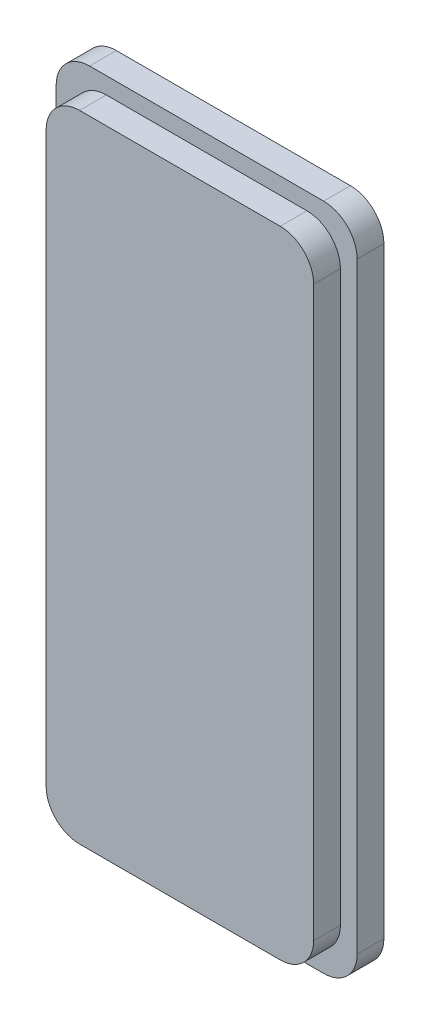
ISO-10303-21;
HEADER;
FILE_DESCRIPTION(('STEP AP214'),'2;1');
FILE_NAME('part.step','',(''),(''),'','','');
FILE_SCHEMA(('AUTOMOTIVE_DESIGN { 1 0 10303 214 1 1 1 1 }'));
ENDSEC;
DATA;
#1=APPLICATION_CONTEXT('core data for automotive mechanical design processes');
#2=APPLICATION_PROTOCOL_DEFINITION('international standard','automotive_design',2000,#1);
#3=PRODUCT_CONTEXT('',#1,'mechanical');
#4=PRODUCT('Part','Part','',(#3));
#5=PRODUCT_RELATED_PRODUCT_CATEGORY('part','',(#4));
#6=PRODUCT_DEFINITION_FORMATION('','',#4);
#7=PRODUCT_DEFINITION_CONTEXT('part definition',#1,'design');
#8=PRODUCT_DEFINITION('design','',#6,#7);
#9=PRODUCT_DEFINITION_SHAPE('','',#8);
#10=(LENGTH_UNIT() NAMED_UNIT(*) SI_UNIT(.MILLI.,.METRE.));
#11=(NAMED_UNIT(*) PLANE_ANGLE_UNIT() SI_UNIT($,.RADIAN.));
#12=(NAMED_UNIT(*) SI_UNIT($,.STERADIAN.) SOLID_ANGLE_UNIT());
#13=UNCERTAINTY_MEASURE_WITH_UNIT(LENGTH_MEASURE(1.E-05),#10,'distance_accuracy_value','');
#14=(GEOMETRIC_REPRESENTATION_CONTEXT(3) GLOBAL_UNCERTAINTY_ASSIGNED_CONTEXT((#13)) GLOBAL_UNIT_ASSIGNED_CONTEXT((#10,
#11,#12)) REPRESENTATION_CONTEXT('',''));
#15=CARTESIAN_POINT('',(0.,0.,0.));
#16=DIRECTION('',(0.,0.,1.));
#17=DIRECTION('',(1.,0.,0.));
#18=AXIS2_PLACEMENT_3D('',#15,#16,#17);
#19=CARTESIAN_POINT('',(0.,0.,4.));
#20=DIRECTION('',(0.,0.,-1.));
#21=DIRECTION('',(-1.,0.,0.));
#22=AXIS2_PLACEMENT_3D('',#19,#20,#21);
#23=PLANE('',#22);
#24=DIRECTION('',(1.,0.,0.));
#25=VECTOR('',#24,1.);
#26=CARTESIAN_POINT('',(-22.5,-50.,4.));
#27=LINE('',#26,#25);
#28=CARTESIAN_POINT('',(-17.5,-50.,4.));
#29=VERTEX_POINT('',#28);
#30=CARTESIAN_POINT('',(17.5,-50.,4.));
#31=VERTEX_POINT('',#30);
#32=EDGE_CURVE('E195',#29,#31,#27,.T.);
#33=ORIENTED_EDGE('',*,*,#32,.T.);
#34=CARTESIAN_POINT('',(17.5,-45.,4.));
#35=DIRECTION('',(0.,0.,-1.));
#36=DIRECTION('',(-1.,0.,0.));
#37=AXIS2_PLACEMENT_3D('',#34,#35,#36);
#38=CIRCLE('',#37,5.);
#39=CARTESIAN_POINT('',(22.5,-45.,4.));
#40=VERTEX_POINT('',#39);
#41=EDGE_CURVE('E254',#31,#40,#38,.F.);
#42=ORIENTED_EDGE('',*,*,#41,.T.);
#43=DIRECTION('',(0.,1.,0.));
#44=VECTOR('',#43,1.);
#45=CARTESIAN_POINT('',(22.5,-50.,4.));
#46=LINE('',#45,#44);
#47=CARTESIAN_POINT('',(22.5,45.,4.));
#48=VERTEX_POINT('',#47);
#49=EDGE_CURVE('E187',#40,#48,#46,.T.);
#50=ORIENTED_EDGE('',*,*,#49,.T.);
#51=CARTESIAN_POINT('',(17.5,45.,4.));
#52=DIRECTION('',(0.,0.,-1.));
#53=DIRECTION('',(-1.,0.,0.));
#54=AXIS2_PLACEMENT_3D('',#51,#52,#53);
#55=CIRCLE('',#54,5.);
#56=CARTESIAN_POINT('',(17.5,50.,4.));
#57=VERTEX_POINT('',#56);
#58=EDGE_CURVE('E250',#48,#57,#55,.F.);
#59=ORIENTED_EDGE('',*,*,#58,.T.);
#60=DIRECTION('',(-1.,0.,0.));
#61=VECTOR('',#60,1.);
#62=CARTESIAN_POINT('',(-22.5,50.,4.));
#63=LINE('',#62,#61);
#64=CARTESIAN_POINT('',(-17.5,50.,4.));
#65=VERTEX_POINT('',#64);
#66=EDGE_CURVE('E190',#57,#65,#63,.T.);
#67=ORIENTED_EDGE('',*,*,#66,.T.);
#68=CARTESIAN_POINT('',(-17.5,45.,4.));
#69=DIRECTION('',(0.,0.,-1.));
#70=DIRECTION('',(-1.,0.,0.));
#71=AXIS2_PLACEMENT_3D('',#68,#69,#70);
#72=CIRCLE('',#71,5.);
#73=CARTESIAN_POINT('',(-22.5,45.,4.));
#74=VERTEX_POINT('',#73);
#75=EDGE_CURVE('E59',#65,#74,#72,.F.);
#76=ORIENTED_EDGE('',*,*,#75,.T.);
#77=DIRECTION('',(0.,-1.,0.));
#78=VECTOR('',#77,1.);
#79=CARTESIAN_POINT('',(-22.5,-50.,4.));
#80=LINE('',#79,#78);
#81=CARTESIAN_POINT('',(-22.5,-45.,4.));
#82=VERTEX_POINT('',#81);
#83=EDGE_CURVE('E193',#74,#82,#80,.T.);
#84=ORIENTED_EDGE('',*,*,#83,.T.);
#85=CARTESIAN_POINT('',(-17.5,-45.,4.));
#86=DIRECTION('',(0.,0.,-1.));
#87=DIRECTION('',(-1.,0.,0.));
#88=AXIS2_PLACEMENT_3D('',#85,#86,#87);
#89=CIRCLE('',#88,5.);
#90=EDGE_CURVE('E252',#82,#29,#89,.F.);
#91=ORIENTED_EDGE('',*,*,#90,.T.);
#92=EDGE_LOOP('',(#33,#42,#50,#59,#67,#76,#84,#91));
#93=FACE_BOUND('',#92,.T.);
#94=DIRECTION('',(0.,1.,0.));
#95=VECTOR('',#94,1.);
#96=CARTESIAN_POINT('',(20.,-47.5,4.));
#97=LINE('',#96,#95);
#98=CARTESIAN_POINT('',(20.,-42.5,4.));
#99=VERTEX_POINT('',#98);
#100=CARTESIAN_POINT('',(20.,42.5,4.));
#101=VERTEX_POINT('',#100);
#102=EDGE_CURVE('E183',#99,#101,#97,.T.);
#103=ORIENTED_EDGE('',*,*,#102,.F.);
#104=CARTESIAN_POINT('',(15.,-42.5,4.));
#105=DIRECTION('',(0.,0.,-1.));
#106=DIRECTION('',(-1.,0.,0.));
#107=AXIS2_PLACEMENT_3D('',#104,#105,#106);
#108=CIRCLE('',#107,5.);
#109=CARTESIAN_POINT('',(15.,-47.5,4.));
#110=VERTEX_POINT('',#109);
#111=EDGE_CURVE('E45',#99,#110,#108,.T.);
#112=ORIENTED_EDGE('',*,*,#111,.T.);
#113=DIRECTION('',(1.,0.,0.));
#114=VECTOR('',#113,1.);
#115=CARTESIAN_POINT('',(-20.,-47.5,4.));
#116=LINE('',#115,#114);
#117=CARTESIAN_POINT('',(-15.,-47.5,4.));
#118=VERTEX_POINT('',#117);
#119=EDGE_CURVE('E177',#118,#110,#116,.T.);
#120=ORIENTED_EDGE('',*,*,#119,.F.);
#121=CARTESIAN_POINT('',(-15.,-42.5,4.));
#122=DIRECTION('',(0.,0.,-1.));
#123=DIRECTION('',(-1.,0.,0.));
#124=AXIS2_PLACEMENT_3D('',#121,#122,#123);
#125=CIRCLE('',#124,5.);
#126=CARTESIAN_POINT('',(-20.,-42.5,4.));
#127=VERTEX_POINT('',#126);
#128=EDGE_CURVE('E11',#118,#127,#125,.T.);
#129=ORIENTED_EDGE('',*,*,#128,.T.);
#130=DIRECTION('',(0.,-1.,0.));
#131=VECTOR('',#130,1.);
#132=CARTESIAN_POINT('',(-20.,-47.5,4.));
#133=LINE('',#132,#131);
#134=CARTESIAN_POINT('',(-20.,42.5,4.));
#135=VERTEX_POINT('',#134);
#136=EDGE_CURVE('E168',#135,#127,#133,.T.);
#137=ORIENTED_EDGE('',*,*,#136,.F.);
#138=CARTESIAN_POINT('',(-15.,42.5,4.));
#139=DIRECTION('',(0.,0.,-1.));
#140=DIRECTION('',(-1.,0.,0.));
#141=AXIS2_PLACEMENT_3D('',#138,#139,#140);
#142=CIRCLE('',#141,5.);
#143=CARTESIAN_POINT('',(-15.,47.5,4.));
#144=VERTEX_POINT('',#143);
#145=EDGE_CURVE('E151',#135,#144,#142,.T.);
#146=ORIENTED_EDGE('',*,*,#145,.T.);
#147=DIRECTION('',(-1.,0.,0.));
#148=VECTOR('',#147,1.);
#149=CARTESIAN_POINT('',(-20.,47.5,4.));
#150=LINE('',#149,#148);
#151=CARTESIAN_POINT('',(15.,47.5,4.));
#152=VERTEX_POINT('',#151);
#153=EDGE_CURVE('E178',#152,#144,#150,.T.);
#154=ORIENTED_EDGE('',*,*,#153,.F.);
#155=CARTESIAN_POINT('',(15.,42.5,4.));
#156=DIRECTION('',(0.,0.,-1.));
#157=DIRECTION('',(-1.,0.,0.));
#158=AXIS2_PLACEMENT_3D('',#155,#156,#157);
#159=CIRCLE('',#158,5.);
#160=EDGE_CURVE('E161',#152,#101,#159,.T.);
#161=ORIENTED_EDGE('',*,*,#160,.T.);
#162=EDGE_LOOP('',(#103,#112,#120,#129,#137,#146,#154,#161));
#163=FACE_BOUND('',#162,.T.);
#164=ADVANCED_FACE('F37',(#93,#163),#23,.F.);
#165=CARTESIAN_POINT('',(22.5,-50.,4.));
#166=DIRECTION('',(-1.,0.,0.));
#167=DIRECTION('',(0.,0.,1.));
#168=AXIS2_PLACEMENT_3D('',#165,#166,#167);
#169=PLANE('',#168);
#170=ORIENTED_EDGE('',*,*,#49,.F.);
#171=DIRECTION('',(0.,0.,-1.));
#172=VECTOR('',#171,1.);
#173=CARTESIAN_POINT('',(22.5,-45.,4.));
#174=LINE('',#173,#172);
#175=CARTESIAN_POINT('',(22.5,-45.,0.));
#176=VERTEX_POINT('',#175);
#177=EDGE_CURVE('E233',#40,#176,#174,.T.);
#178=ORIENTED_EDGE('',*,*,#177,.T.);
#179=DIRECTION('',(0.,1.,0.));
#180=VECTOR('',#179,1.);
#181=CARTESIAN_POINT('',(22.5,-50.,0.));
#182=LINE('',#181,#180);
#183=CARTESIAN_POINT('',(22.5,45.,0.));
#184=VERTEX_POINT('',#183);
#185=EDGE_CURVE('E198',#176,#184,#182,.T.);
#186=ORIENTED_EDGE('',*,*,#185,.T.);
#187=DIRECTION('',(0.,0.,-1.));
#188=VECTOR('',#187,1.);
#189=CARTESIAN_POINT('',(22.5,45.,4.));
#190=LINE('',#189,#188);
#191=EDGE_CURVE('E231',#184,#48,#190,.F.);
#192=ORIENTED_EDGE('',*,*,#191,.T.);
#193=EDGE_LOOP('',(#170,#178,#186,#192));
#194=FACE_BOUND('',#193,.T.);
#195=ADVANCED_FACE('F305',(#194),#169,.F.);
#196=CARTESIAN_POINT('',(-22.5,50.,4.));
#197=DIRECTION('',(0.,-1.,0.));
#198=DIRECTION('',(0.,0.,-1.));
#199=AXIS2_PLACEMENT_3D('',#196,#197,#198);
#200=PLANE('',#199);
#201=ORIENTED_EDGE('',*,*,#66,.F.);
#202=DIRECTION('',(0.,0.,-1.));
#203=VECTOR('',#202,1.);
#204=CARTESIAN_POINT('',(17.5,50.,4.));
#205=LINE('',#204,#203);
#206=CARTESIAN_POINT('',(17.5,50.,0.));
#207=VERTEX_POINT('',#206);
#208=EDGE_CURVE('E162',#57,#207,#205,.T.);
#209=ORIENTED_EDGE('',*,*,#208,.T.);
#210=DIRECTION('',(-1.,0.,0.));
#211=VECTOR('',#210,1.);
#212=CARTESIAN_POINT('',(-22.5,50.,0.));
#213=LINE('',#212,#211);
#214=CARTESIAN_POINT('',(-17.5,50.,0.));
#215=VERTEX_POINT('',#214);
#216=EDGE_CURVE('E201',#207,#215,#213,.T.);
#217=ORIENTED_EDGE('',*,*,#216,.T.);
#218=DIRECTION('',(0.,0.,-1.));
#219=VECTOR('',#218,1.);
#220=CARTESIAN_POINT('',(-17.5,50.,4.));
#221=LINE('',#220,#219);
#222=EDGE_CURVE('E260',#215,#65,#221,.F.);
#223=ORIENTED_EDGE('',*,*,#222,.T.);
#224=EDGE_LOOP('',(#201,#209,#217,#223));
#225=FACE_BOUND('',#224,.T.);
#226=ADVANCED_FACE('F310',(#225),#200,.F.);
#227=CARTESIAN_POINT('',(-22.5,-50.,4.));
#228=DIRECTION('',(1.,0.,0.));
#229=DIRECTION('',(0.,0.,-1.));
#230=AXIS2_PLACEMENT_3D('',#227,#228,#229);
#231=PLANE('',#230);
#232=DIRECTION('',(0.,-1.,0.));
#233=VECTOR('',#232,1.);
#234=CARTESIAN_POINT('',(-22.5,-50.,0.));
#235=LINE('',#234,#233);
#236=CARTESIAN_POINT('',(-22.5,45.,0.));
#237=VERTEX_POINT('',#236);
#238=CARTESIAN_POINT('',(-22.5,-45.,0.));
#239=VERTEX_POINT('',#238);
#240=EDGE_CURVE('E205',#237,#239,#235,.T.);
#241=ORIENTED_EDGE('',*,*,#240,.T.);
#242=DIRECTION('',(0.,0.,-1.));
#243=VECTOR('',#242,1.);
#244=CARTESIAN_POINT('',(-22.5,-45.,4.));
#245=LINE('',#244,#243);
#246=EDGE_CURVE('E52',#239,#82,#245,.F.);
#247=ORIENTED_EDGE('',*,*,#246,.T.);
#248=ORIENTED_EDGE('',*,*,#83,.F.);
#249=DIRECTION('',(0.,0.,-1.));
#250=VECTOR('',#249,1.);
#251=CARTESIAN_POINT('',(-22.5,45.,4.));
#252=LINE('',#251,#250);
#253=EDGE_CURVE('E256',#74,#237,#252,.T.);
#254=ORIENTED_EDGE('',*,*,#253,.T.);
#255=EDGE_LOOP('',(#241,#247,#248,#254));
#256=FACE_BOUND('',#255,.T.);
#257=ADVANCED_FACE('F320',(#256),#231,.F.);
#258=CARTESIAN_POINT('',(-22.5,-50.,4.));
#259=DIRECTION('',(0.,1.,0.));
#260=DIRECTION('',(0.,0.,1.));
#261=AXIS2_PLACEMENT_3D('',#258,#259,#260);
#262=PLANE('',#261);
#263=DIRECTION('',(1.,0.,0.));
#264=VECTOR('',#263,1.);
#265=CARTESIAN_POINT('',(-22.5,-50.,0.));
#266=LINE('',#265,#264);
#267=CARTESIAN_POINT('',(-17.5,-50.,0.));
#268=VERTEX_POINT('',#267);
#269=CARTESIAN_POINT('',(17.5,-50.,0.));
#270=VERTEX_POINT('',#269);
#271=EDGE_CURVE('E191',#268,#270,#266,.T.);
#272=ORIENTED_EDGE('',*,*,#271,.T.);
#273=DIRECTION('',(0.,0.,-1.));
#274=VECTOR('',#273,1.);
#275=CARTESIAN_POINT('',(17.5,-50.,4.));
#276=LINE('',#275,#274);
#277=EDGE_CURVE('E247',#270,#31,#276,.F.);
#278=ORIENTED_EDGE('',*,*,#277,.T.);
#279=ORIENTED_EDGE('',*,*,#32,.F.);
#280=DIRECTION('',(0.,0.,-1.));
#281=VECTOR('',#280,1.);
#282=CARTESIAN_POINT('',(-17.5,-50.,4.));
#283=LINE('',#282,#281);
#284=EDGE_CURVE('E244',#29,#268,#283,.T.);
#285=ORIENTED_EDGE('',*,*,#284,.T.);
#286=EDGE_LOOP('',(#272,#278,#279,#285));
#287=FACE_BOUND('',#286,.T.);
#288=ADVANCED_FACE('F316',(#287),#262,.F.);
#289=CARTESIAN_POINT('',(0.,0.,0.));
#290=DIRECTION('',(0.,0.,-1.));
#291=DIRECTION('',(-1.,0.,0.));
#292=AXIS2_PLACEMENT_3D('',#289,#290,#291);
#293=PLANE('',#292);
#294=ORIENTED_EDGE('',*,*,#185,.F.);
#295=CARTESIAN_POINT('',(17.5,-45.,0.));
#296=DIRECTION('',(0.,0.,-1.));
#297=DIRECTION('',(-1.,0.,0.));
#298=AXIS2_PLACEMENT_3D('',#295,#296,#297);
#299=CIRCLE('',#298,5.);
#300=EDGE_CURVE('E242',#176,#270,#299,.T.);
#301=ORIENTED_EDGE('',*,*,#300,.T.);
#302=ORIENTED_EDGE('',*,*,#271,.F.);
#303=CARTESIAN_POINT('',(-17.5,-45.,0.));
#304=DIRECTION('',(0.,0.,-1.));
#305=DIRECTION('',(-1.,0.,0.));
#306=AXIS2_PLACEMENT_3D('',#303,#304,#305);
#307=CIRCLE('',#306,5.);
#308=EDGE_CURVE('E240',#268,#239,#307,.T.);
#309=ORIENTED_EDGE('',*,*,#308,.T.);
#310=ORIENTED_EDGE('',*,*,#240,.F.);
#311=CARTESIAN_POINT('',(-17.5,45.,0.));
#312=DIRECTION('',(0.,0.,-1.));
#313=DIRECTION('',(-1.,0.,0.));
#314=AXIS2_PLACEMENT_3D('',#311,#312,#313);
#315=CIRCLE('',#314,5.);
#316=EDGE_CURVE('E236',#237,#215,#315,.T.);
#317=ORIENTED_EDGE('',*,*,#316,.T.);
#318=ORIENTED_EDGE('',*,*,#216,.F.);
#319=CARTESIAN_POINT('',(17.5,45.,0.));
#320=DIRECTION('',(0.,0.,-1.));
#321=DIRECTION('',(-1.,0.,0.));
#322=AXIS2_PLACEMENT_3D('',#319,#320,#321);
#323=CIRCLE('',#322,5.);
#324=EDGE_CURVE('E238',#207,#184,#323,.T.);
#325=ORIENTED_EDGE('',*,*,#324,.T.);
#326=EDGE_LOOP('',(#294,#301,#302,#309,#310,#317,#318,#325));
#327=FACE_BOUND('',#326,.T.);
#328=ADVANCED_FACE('F302',(#327),#293,.T.);
#329=CARTESIAN_POINT('',(20.,-47.5,8.));
#330=DIRECTION('',(-1.,0.,0.));
#331=DIRECTION('',(0.,0.,1.));
#332=AXIS2_PLACEMENT_3D('',#329,#330,#331);
#333=PLANE('',#332);
#334=ORIENTED_EDGE('',*,*,#102,.T.);
#335=DIRECTION('',(0.,0.,-1.));
#336=VECTOR('',#335,1.);
#337=CARTESIAN_POINT('',(20.,42.5,8.));
#338=LINE('',#337,#336);
#339=CARTESIAN_POINT('',(20.,42.5,8.));
#340=VERTEX_POINT('',#339);
#341=EDGE_CURVE('E224',#101,#340,#338,.F.);
#342=ORIENTED_EDGE('',*,*,#341,.T.);
#343=DIRECTION('',(0.,1.,0.));
#344=VECTOR('',#343,1.);
#345=CARTESIAN_POINT('',(20.,-47.5,8.));
#346=LINE('',#345,#344);
#347=CARTESIAN_POINT('',(20.,-42.5,8.));
#348=VERTEX_POINT('',#347);
#349=EDGE_CURVE('E181',#348,#340,#346,.T.);
#350=ORIENTED_EDGE('',*,*,#349,.F.);
#351=DIRECTION('',(0.,0.,-1.));
#352=VECTOR('',#351,1.);
#353=CARTESIAN_POINT('',(20.,-42.5,8.));
#354=LINE('',#353,#352);
#355=EDGE_CURVE('E221',#348,#99,#354,.T.);
#356=ORIENTED_EDGE('',*,*,#355,.T.);
#357=EDGE_LOOP('',(#334,#342,#350,#356));
#358=FACE_BOUND('',#357,.T.);
#359=ADVANCED_FACE('F282',(#358),#333,.F.);
#360=CARTESIAN_POINT('',(-20.,47.5,8.));
#361=DIRECTION('',(0.,-1.,0.));
#362=DIRECTION('',(0.,0.,-1.));
#363=AXIS2_PLACEMENT_3D('',#360,#361,#362);
#364=PLANE('',#363);
#365=ORIENTED_EDGE('',*,*,#153,.T.);
#366=DIRECTION('',(0.,0.,-1.));
#367=VECTOR('',#366,1.);
#368=CARTESIAN_POINT('',(-15.,47.5,8.));
#369=LINE('',#368,#367);
#370=CARTESIAN_POINT('',(-15.,47.5,8.));
#371=VERTEX_POINT('',#370);
#372=EDGE_CURVE('E156',#144,#371,#369,.F.);
#373=ORIENTED_EDGE('',*,*,#372,.T.);
#374=DIRECTION('',(-1.,0.,0.));
#375=VECTOR('',#374,1.);
#376=CARTESIAN_POINT('',(-20.,47.5,8.));
#377=LINE('',#376,#375);
#378=CARTESIAN_POINT('',(15.,47.5,8.));
#379=VERTEX_POINT('',#378);
#380=EDGE_CURVE('E284',#379,#371,#377,.T.);
#381=ORIENTED_EDGE('',*,*,#380,.F.);
#382=DIRECTION('',(0.,0.,-1.));
#383=VECTOR('',#382,1.);
#384=CARTESIAN_POINT('',(15.,47.5,8.));
#385=LINE('',#384,#383);
#386=EDGE_CURVE('E172',#379,#152,#385,.T.);
#387=ORIENTED_EDGE('',*,*,#386,.T.);
#388=EDGE_LOOP('',(#365,#373,#381,#387));
#389=FACE_BOUND('',#388,.T.);
#390=ADVANCED_FACE('F294',(#389),#364,.F.);
#391=CARTESIAN_POINT('',(-20.,-47.5,8.));
#392=DIRECTION('',(1.,0.,0.));
#393=DIRECTION('',(0.,0.,-1.));
#394=AXIS2_PLACEMENT_3D('',#391,#392,#393);
#395=PLANE('',#394);
#396=DIRECTION('',(0.,-1.,0.));
#397=VECTOR('',#396,1.);
#398=CARTESIAN_POINT('',(-20.,-47.5,8.));
#399=LINE('',#398,#397);
#400=CARTESIAN_POINT('',(-20.,42.5,8.));
#401=VERTEX_POINT('',#400);
#402=CARTESIAN_POINT('',(-20.,-42.5,8.));
#403=VERTEX_POINT('',#402);
#404=EDGE_CURVE('E171',#401,#403,#399,.T.);
#405=ORIENTED_EDGE('',*,*,#404,.F.);
#406=DIRECTION('',(0.,0.,-1.));
#407=VECTOR('',#406,1.);
#408=CARTESIAN_POINT('',(-20.,42.5,8.));
#409=LINE('',#408,#407);
#410=EDGE_CURVE('E155',#401,#135,#409,.T.);
#411=ORIENTED_EDGE('',*,*,#410,.T.);
#412=ORIENTED_EDGE('',*,*,#136,.T.);
#413=DIRECTION('',(0.,0.,-1.));
#414=VECTOR('',#413,1.);
#415=CARTESIAN_POINT('',(-20.,-42.5,8.));
#416=LINE('',#415,#414);
#417=EDGE_CURVE('E173',#127,#403,#416,.F.);
#418=ORIENTED_EDGE('',*,*,#417,.T.);
#419=EDGE_LOOP('',(#405,#411,#412,#418));
#420=FACE_BOUND('',#419,.T.);
#421=ADVANCED_FACE('F167',(#420),#395,.F.);
#422=CARTESIAN_POINT('',(-20.,-47.5,8.));
#423=DIRECTION('',(0.,1.,0.));
#424=DIRECTION('',(0.,0.,1.));
#425=AXIS2_PLACEMENT_3D('',#422,#423,#424);
#426=PLANE('',#425);
#427=ORIENTED_EDGE('',*,*,#119,.T.);
#428=DIRECTION('',(0.,0.,-1.));
#429=VECTOR('',#428,1.);
#430=CARTESIAN_POINT('',(15.,-47.5,8.));
#431=LINE('',#430,#429);
#432=CARTESIAN_POINT('',(15.,-47.5,8.));
#433=VERTEX_POINT('',#432);
#434=EDGE_CURVE('E229',#110,#433,#431,.F.);
#435=ORIENTED_EDGE('',*,*,#434,.T.);
#436=DIRECTION('',(1.,0.,0.));
#437=VECTOR('',#436,1.);
#438=CARTESIAN_POINT('',(-20.,-47.5,8.));
#439=LINE('',#438,#437);
#440=CARTESIAN_POINT('',(-15.,-47.5,8.));
#441=VERTEX_POINT('',#440);
#442=EDGE_CURVE('E202',#441,#433,#439,.T.);
#443=ORIENTED_EDGE('',*,*,#442,.F.);
#444=DIRECTION('',(0.,0.,-1.));
#445=VECTOR('',#444,1.);
#446=CARTESIAN_POINT('',(-15.,-47.5,8.));
#447=LINE('',#446,#445);
#448=EDGE_CURVE('E226',#441,#118,#447,.T.);
#449=ORIENTED_EDGE('',*,*,#448,.T.);
#450=EDGE_LOOP('',(#427,#435,#443,#449));
#451=FACE_BOUND('',#450,.T.);
#452=ADVANCED_FACE('F269',(#451),#426,.F.);
#453=CARTESIAN_POINT('',(0.,0.,8.));
#454=DIRECTION('',(0.,0.,-1.));
#455=DIRECTION('',(-1.,0.,0.));
#456=AXIS2_PLACEMENT_3D('',#453,#454,#455);
#457=PLANE('',#456);
#458=ORIENTED_EDGE('',*,*,#380,.T.);
#459=CARTESIAN_POINT('',(-15.,42.5,8.));
#460=DIRECTION('',(0.,0.,-1.));
#461=DIRECTION('',(-1.,0.,0.));
#462=AXIS2_PLACEMENT_3D('',#459,#460,#461);
#463=CIRCLE('',#462,5.);
#464=EDGE_CURVE('E219',#371,#401,#463,.F.);
#465=ORIENTED_EDGE('',*,*,#464,.T.);
#466=ORIENTED_EDGE('',*,*,#404,.T.);
#467=CARTESIAN_POINT('',(-15.,-42.5,8.));
#468=DIRECTION('',(0.,0.,-1.));
#469=DIRECTION('',(-1.,0.,0.));
#470=AXIS2_PLACEMENT_3D('',#467,#468,#469);
#471=CIRCLE('',#470,5.);
#472=EDGE_CURVE('E213',#403,#441,#471,.F.);
#473=ORIENTED_EDGE('',*,*,#472,.T.);
#474=ORIENTED_EDGE('',*,*,#442,.T.);
#475=CARTESIAN_POINT('',(15.,-42.5,8.));
#476=DIRECTION('',(0.,0.,-1.));
#477=DIRECTION('',(-1.,0.,0.));
#478=AXIS2_PLACEMENT_3D('',#475,#476,#477);
#479=CIRCLE('',#478,5.);
#480=EDGE_CURVE('E215',#433,#348,#479,.F.);
#481=ORIENTED_EDGE('',*,*,#480,.T.);
#482=ORIENTED_EDGE('',*,*,#349,.T.);
#483=CARTESIAN_POINT('',(15.,42.5,8.));
#484=DIRECTION('',(0.,0.,-1.));
#485=DIRECTION('',(-1.,0.,0.));
#486=AXIS2_PLACEMENT_3D('',#483,#484,#485);
#487=CIRCLE('',#486,5.);
#488=EDGE_CURVE('E217',#340,#379,#487,.F.);
#489=ORIENTED_EDGE('',*,*,#488,.T.);
#490=EDGE_LOOP('',(#458,#465,#466,#473,#474,#481,#482,#489));
#491=FACE_BOUND('',#490,.T.);
#492=ADVANCED_FACE('F279',(#491),#457,.F.);
#493=CARTESIAN_POINT('',(-15.,42.5,8.));
#494=DIRECTION('',(0.,0.,-1.));
#495=DIRECTION('',(-1.,0.,0.));
#496=AXIS2_PLACEMENT_3D('',#493,#494,#495);
#497=CYLINDRICAL_SURFACE('',#496,5.);
#498=ORIENTED_EDGE('',*,*,#464,.F.);
#499=ORIENTED_EDGE('',*,*,#372,.F.);
#500=ORIENTED_EDGE('',*,*,#145,.F.);
#501=ORIENTED_EDGE('',*,*,#410,.F.);
#502=EDGE_LOOP('',(#498,#499,#500,#501));
#503=FACE_BOUND('',#502,.T.);
#504=ADVANCED_FACE('F154',(#503),#497,.T.);
#505=CARTESIAN_POINT('',(15.,42.5,8.));
#506=DIRECTION('',(0.,0.,-1.));
#507=DIRECTION('',(-1.,0.,0.));
#508=AXIS2_PLACEMENT_3D('',#505,#506,#507);
#509=CYLINDRICAL_SURFACE('',#508,5.);
#510=ORIENTED_EDGE('',*,*,#488,.F.);
#511=ORIENTED_EDGE('',*,*,#341,.F.);
#512=ORIENTED_EDGE('',*,*,#160,.F.);
#513=ORIENTED_EDGE('',*,*,#386,.F.);
#514=EDGE_LOOP('',(#510,#511,#512,#513));
#515=FACE_BOUND('',#514,.T.);
#516=ADVANCED_FACE('F290',(#515),#509,.T.);
#517=CARTESIAN_POINT('',(15.,-42.5,8.));
#518=DIRECTION('',(0.,0.,-1.));
#519=DIRECTION('',(-1.,0.,0.));
#520=AXIS2_PLACEMENT_3D('',#517,#518,#519);
#521=CYLINDRICAL_SURFACE('',#520,5.);
#522=ORIENTED_EDGE('',*,*,#480,.F.);
#523=ORIENTED_EDGE('',*,*,#434,.F.);
#524=ORIENTED_EDGE('',*,*,#111,.F.);
#525=ORIENTED_EDGE('',*,*,#355,.F.);
#526=EDGE_LOOP('',(#522,#523,#524,#525));
#527=FACE_BOUND('',#526,.T.);
#528=ADVANCED_FACE('F274',(#527),#521,.T.);
#529=CARTESIAN_POINT('',(-15.,-42.5,8.));
#530=DIRECTION('',(0.,0.,-1.));
#531=DIRECTION('',(-1.,0.,0.));
#532=AXIS2_PLACEMENT_3D('',#529,#530,#531);
#533=CYLINDRICAL_SURFACE('',#532,5.);
#534=ORIENTED_EDGE('',*,*,#472,.F.);
#535=ORIENTED_EDGE('',*,*,#417,.F.);
#536=ORIENTED_EDGE('',*,*,#128,.F.);
#537=ORIENTED_EDGE('',*,*,#448,.F.);
#538=EDGE_LOOP('',(#534,#535,#536,#537));
#539=FACE_BOUND('',#538,.T.);
#540=ADVANCED_FACE('F333',(#539),#533,.T.);
#541=CARTESIAN_POINT('',(17.5,-45.,4.));
#542=DIRECTION('',(0.,0.,-1.));
#543=DIRECTION('',(-1.,0.,0.));
#544=AXIS2_PLACEMENT_3D('',#541,#542,#543);
#545=CYLINDRICAL_SURFACE('',#544,5.);
#546=ORIENTED_EDGE('',*,*,#41,.F.);
#547=ORIENTED_EDGE('',*,*,#277,.F.);
#548=ORIENTED_EDGE('',*,*,#300,.F.);
#549=ORIENTED_EDGE('',*,*,#177,.F.);
#550=EDGE_LOOP('',(#546,#547,#548,#549));
#551=FACE_BOUND('',#550,.T.);
#552=ADVANCED_FACE('F336',(#551),#545,.T.);
#553=CARTESIAN_POINT('',(-17.5,-45.,4.));
#554=DIRECTION('',(0.,0.,-1.));
#555=DIRECTION('',(-1.,0.,0.));
#556=AXIS2_PLACEMENT_3D('',#553,#554,#555);
#557=CYLINDRICAL_SURFACE('',#556,5.);
#558=ORIENTED_EDGE('',*,*,#90,.F.);
#559=ORIENTED_EDGE('',*,*,#246,.F.);
#560=ORIENTED_EDGE('',*,*,#308,.F.);
#561=ORIENTED_EDGE('',*,*,#284,.F.);
#562=EDGE_LOOP('',(#558,#559,#560,#561));
#563=FACE_BOUND('',#562,.T.);
#564=ADVANCED_FACE('F340',(#563),#557,.T.);
#565=CARTESIAN_POINT('',(17.5,45.,4.));
#566=DIRECTION('',(0.,0.,-1.));
#567=DIRECTION('',(-1.,0.,0.));
#568=AXIS2_PLACEMENT_3D('',#565,#566,#567);
#569=CYLINDRICAL_SURFACE('',#568,5.);
#570=ORIENTED_EDGE('',*,*,#58,.F.);
#571=ORIENTED_EDGE('',*,*,#191,.F.);
#572=ORIENTED_EDGE('',*,*,#324,.F.);
#573=ORIENTED_EDGE('',*,*,#208,.F.);
#574=EDGE_LOOP('',(#570,#571,#572,#573));
#575=FACE_BOUND('',#574,.T.);
#576=ADVANCED_FACE('F343',(#575),#569,.T.);
#577=CARTESIAN_POINT('',(-17.5,45.,4.));
#578=DIRECTION('',(0.,0.,-1.));
#579=DIRECTION('',(-1.,0.,0.));
#580=AXIS2_PLACEMENT_3D('',#577,#578,#579);
#581=CYLINDRICAL_SURFACE('',#580,5.);
#582=ORIENTED_EDGE('',*,*,#75,.F.);
#583=ORIENTED_EDGE('',*,*,#222,.F.);
#584=ORIENTED_EDGE('',*,*,#316,.F.);
#585=ORIENTED_EDGE('',*,*,#253,.F.);
#586=EDGE_LOOP('',(#582,#583,#584,#585));
#587=FACE_BOUND('',#586,.T.);
#588=ADVANCED_FACE('F39',(#587),#581,.T.);
#589=CLOSED_SHELL('',(#164,#195,#226,#257,#288,#328,#359,#390,#421,#452,#492,#504,#516,#528,
#540,#552,#564,#576,#588));
#590=MANIFOLD_SOLID_BREP('B2',#589);
#591=ADVANCED_BREP_SHAPE_REPRESENTATION('',(#18,#590),#14);
#592=SHAPE_DEFINITION_REPRESENTATION(#9,#591);
ENDSEC;
END-ISO-10303-21;
